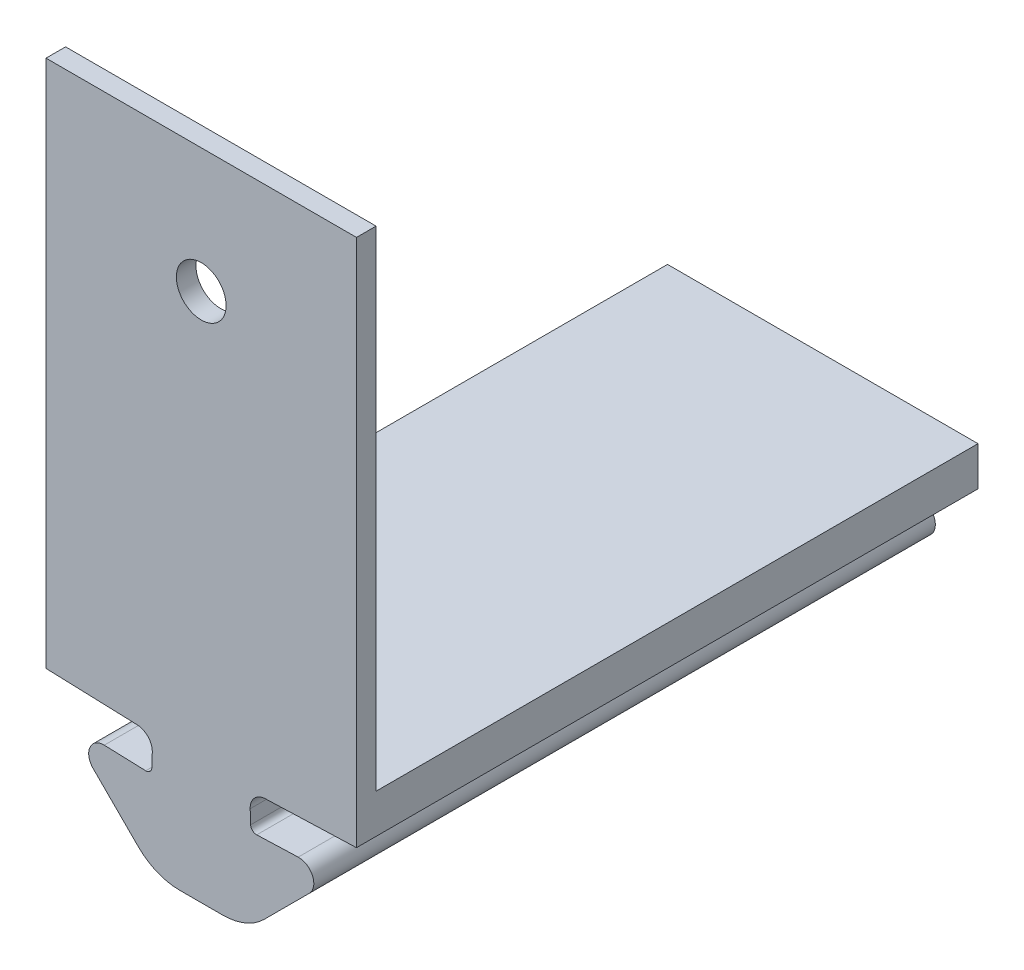
ISO-10303-21;
HEADER;
FILE_DESCRIPTION(('STEP AP214'),'2;1');
FILE_NAME('part.step','',(''),(''),'','','');
FILE_SCHEMA(('AUTOMOTIVE_DESIGN { 1 0 10303 214 1 1 1 1 }'));
ENDSEC;
DATA;
#1=APPLICATION_CONTEXT('core data for automotive mechanical design processes');
#2=APPLICATION_PROTOCOL_DEFINITION('international standard','automotive_design',2000,#1);
#3=PRODUCT_CONTEXT('',#1,'mechanical');
#4=PRODUCT('Part','Part','',(#3));
#5=PRODUCT_RELATED_PRODUCT_CATEGORY('part','',(#4));
#6=PRODUCT_DEFINITION_FORMATION('','',#4);
#7=PRODUCT_DEFINITION_CONTEXT('part definition',#1,'design');
#8=PRODUCT_DEFINITION('design','',#6,#7);
#9=PRODUCT_DEFINITION_SHAPE('','',#8);
#10=(LENGTH_UNIT() NAMED_UNIT(*) SI_UNIT(.MILLI.,.METRE.));
#11=(NAMED_UNIT(*) PLANE_ANGLE_UNIT() SI_UNIT($,.RADIAN.));
#12=(NAMED_UNIT(*) SI_UNIT($,.STERADIAN.) SOLID_ANGLE_UNIT());
#13=UNCERTAINTY_MEASURE_WITH_UNIT(LENGTH_MEASURE(1.E-05),#10,'distance_accuracy_value','');
#14=(GEOMETRIC_REPRESENTATION_CONTEXT(3) GLOBAL_UNCERTAINTY_ASSIGNED_CONTEXT((#13)) GLOBAL_UNIT_ASSIGNED_CONTEXT((#10,
#11,#12)) REPRESENTATION_CONTEXT('',''));
#15=CARTESIAN_POINT('',(0.,0.,0.));
#16=DIRECTION('',(0.,0.,1.));
#17=DIRECTION('',(1.,0.,0.));
#18=AXIS2_PLACEMENT_3D('',#15,#16,#17);
#19=CARTESIAN_POINT('',(-50.6754357820215,45.6203327442278,31.75));
#20=DIRECTION('',(0.,0.,-1.));
#21=DIRECTION('',(-1.,0.,0.));
#22=AXIS2_PLACEMENT_3D('',#19,#20,#21);
#23=CYLINDRICAL_SURFACE('',#22,0.300000000000002);
#24=CARTESIAN_POINT('',(-50.6754357820215,45.6203327442278,0.));
#25=DIRECTION('',(0.,0.,-1.));
#26=DIRECTION('',(1.,0.,0.));
#27=AXIS2_PLACEMENT_3D('',#24,#25,#26);
#28=CIRCLE('',#27,0.300000000000002);
#29=CARTESIAN_POINT('',(-50.3756185339158,45.609862895217,0.));
#30=VERTEX_POINT('',#29);
#31=CARTESIAN_POINT('',(-50.6859056310322,45.320515496122,0.));
#32=VERTEX_POINT('',#31);
#33=EDGE_CURVE('E167',#30,#32,#28,.T.);
#34=ORIENTED_EDGE('',*,*,#33,.T.);
#35=DIRECTION('',(0.,0.,-1.));
#36=VECTOR('',#35,1.);
#37=CARTESIAN_POINT('',(-50.6859056310322,45.320515496122,31.75));
#38=LINE('',#37,#36);
#39=CARTESIAN_POINT('',(-50.6859056310322,45.320515496122,31.75));
#40=VERTEX_POINT('',#39);
#41=EDGE_CURVE('E11',#40,#32,#38,.T.);
#42=ORIENTED_EDGE('',*,*,#41,.F.);
#43=CARTESIAN_POINT('',(-50.6754357820215,45.6203327442278,31.75));
#44=DIRECTION('',(0.,0.,-1.));
#45=DIRECTION('',(1.,0.,0.));
#46=AXIS2_PLACEMENT_3D('',#43,#44,#45);
#47=CIRCLE('',#46,0.300000000000002);
#48=CARTESIAN_POINT('',(-50.3756185339158,45.609862895217,31.75));
#49=VERTEX_POINT('',#48);
#50=EDGE_CURVE('E195',#49,#40,#47,.T.);
#51=ORIENTED_EDGE('',*,*,#50,.F.);
#52=DIRECTION('',(0.,0.,-1.));
#53=VECTOR('',#52,1.);
#54=CARTESIAN_POINT('',(-50.3756185339158,45.609862895217,31.75));
#55=LINE('',#54,#53);
#56=EDGE_CURVE('E163',#49,#30,#55,.T.);
#57=ORIENTED_EDGE('',*,*,#56,.T.);
#58=EDGE_LOOP('',(#34,#42,#51,#57));
#59=FACE_BOUND('',#58,.T.);
#60=ADVANCED_FACE('F47',(#59),#23,.F.);
#61=CARTESIAN_POINT('',(-50.6859056310322,45.320515496122,31.75));
#62=DIRECTION('',(-0.0348994967024436,-0.999390827019098,0.));
#63=DIRECTION('',(0.999390827019098,-0.0348994967024436,0.));
#64=AXIS2_PLACEMENT_3D('',#61,#62,#63);
#65=PLANE('',#64);
#66=DIRECTION('',(-0.999390827019098,0.0348994967024436,0.));
#67=VECTOR('',#66,1.);
#68=CARTESIAN_POINT('',(-50.6859056310322,45.320515496122,0.));
#69=LINE('',#68,#67);
#70=CARTESIAN_POINT('',(-52.803734095959,45.3944716957687,0.));
#71=VERTEX_POINT('',#70);
#72=EDGE_CURVE('E171',#32,#71,#69,.T.);
#73=ORIENTED_EDGE('',*,*,#72,.T.);
#74=DIRECTION('',(0.,0.,-1.));
#75=VECTOR('',#74,1.);
#76=CARTESIAN_POINT('',(-52.803734095959,45.3944716957687,31.75));
#77=LINE('',#76,#75);
#78=CARTESIAN_POINT('',(-52.803734095959,45.3944716957687,31.75));
#79=VERTEX_POINT('',#78);
#80=EDGE_CURVE('E55',#79,#71,#77,.T.);
#81=ORIENTED_EDGE('',*,*,#80,.F.);
#82=DIRECTION('',(-0.999390827019098,0.0348994967024436,0.));
#83=VECTOR('',#82,1.);
#84=CARTESIAN_POINT('',(-50.6859056310322,45.320515496122,31.75));
#85=LINE('',#84,#83);
#86=EDGE_CURVE('E115',#40,#79,#85,.T.);
#87=ORIENTED_EDGE('',*,*,#86,.F.);
#88=ORIENTED_EDGE('',*,*,#41,.T.);
#89=EDGE_LOOP('',(#73,#81,#87,#88));
#90=FACE_BOUND('',#89,.T.);
#91=ADVANCED_FACE('F506',(#90),#65,.F.);
#92=CARTESIAN_POINT('',(-52.8306099066512,44.6248491736012,31.75));
#93=DIRECTION('',(0.,0.,-1.));
#94=DIRECTION('',(-1.,0.,0.));
#95=AXIS2_PLACEMENT_3D('',#92,#93,#94);
#96=CYLINDRICAL_SURFACE('',#95,0.770091641188153);
#97=CARTESIAN_POINT('',(-52.8306099066512,44.6248491736012,0.));
#98=DIRECTION('',(0.,0.,1.));
#99=DIRECTION('',(1.,0.,0.));
#100=AXIS2_PLACEMENT_3D('',#97,#98,#99);
#101=CIRCLE('',#100,0.770091641188153);
#102=CARTESIAN_POINT('',(-53.3751469282704,44.0803121519819,0.));
#103=VERTEX_POINT('',#102);
#104=EDGE_CURVE('E175',#71,#103,#101,.T.);
#105=ORIENTED_EDGE('',*,*,#104,.T.);
#106=DIRECTION('',(0.,0.,-1.));
#107=VECTOR('',#106,1.);
#108=CARTESIAN_POINT('',(-53.3751469282704,44.0803121519819,31.75));
#109=LINE('',#108,#107);
#110=CARTESIAN_POINT('',(-53.3751469282704,44.0803121519819,31.75));
#111=VERTEX_POINT('',#110);
#112=EDGE_CURVE('E210',#111,#103,#109,.T.);
#113=ORIENTED_EDGE('',*,*,#112,.F.);
#114=CARTESIAN_POINT('',(-52.8306099066512,44.6248491736012,31.75));
#115=DIRECTION('',(0.,0.,1.));
#116=DIRECTION('',(1.,0.,0.));
#117=AXIS2_PLACEMENT_3D('',#114,#115,#116);
#118=CIRCLE('',#117,0.770091641188153);
#119=EDGE_CURVE('E220',#79,#111,#118,.T.);
#120=ORIENTED_EDGE('',*,*,#119,.F.);
#121=ORIENTED_EDGE('',*,*,#80,.T.);
#122=EDGE_LOOP('',(#105,#113,#120,#121));
#123=FACE_BOUND('',#122,.T.);
#124=ADVANCED_FACE('F218',(#123),#96,.T.);
#125=CARTESIAN_POINT('',(-51.0742666676735,41.7794318913851,31.75));
#126=DIRECTION('',(0.707106781186544,0.707106781186551,0.));
#127=DIRECTION('',(-0.707106781186551,0.707106781186544,0.));
#128=AXIS2_PLACEMENT_3D('',#125,#126,#127);
#129=PLANE('',#128);
#130=DIRECTION('',(0.707106781186551,-0.707106781186544,0.));
#131=VECTOR('',#130,1.);
#132=CARTESIAN_POINT('',(-51.0742666676735,41.7794318913851,0.));
#133=LINE('',#132,#131);
#134=CARTESIAN_POINT('',(-51.0742666676735,41.7794318913851,0.));
#135=VERTEX_POINT('',#134);
#136=EDGE_CURVE('E178',#103,#135,#133,.T.);
#137=ORIENTED_EDGE('',*,*,#136,.T.);
#138=DIRECTION('',(0.,0.,-1.));
#139=VECTOR('',#138,1.);
#140=CARTESIAN_POINT('',(-51.0742666676735,41.7794318913851,31.75));
#141=LINE('',#140,#139);
#142=CARTESIAN_POINT('',(-51.0742666676735,41.7794318913851,31.75));
#143=VERTEX_POINT('',#142);
#144=EDGE_CURVE('E206',#143,#135,#141,.T.);
#145=ORIENTED_EDGE('',*,*,#144,.F.);
#146=DIRECTION('',(0.707106781186551,-0.707106781186544,0.));
#147=VECTOR('',#146,1.);
#148=CARTESIAN_POINT('',(-51.0742666676735,41.7794318913851,31.75));
#149=LINE('',#148,#147);
#150=EDGE_CURVE('E239',#111,#143,#149,.T.);
#151=ORIENTED_EDGE('',*,*,#150,.F.);
#152=ORIENTED_EDGE('',*,*,#112,.T.);
#153=EDGE_LOOP('',(#137,#145,#151,#152));
#154=FACE_BOUND('',#153,.T.);
#155=ADVANCED_FACE('F229',(#154),#129,.F.);
#156=CARTESIAN_POINT('',(-48.9529463241139,43.9007522349447,31.75));
#157=DIRECTION('',(0.,0.,-1.));
#158=DIRECTION('',(-1.,0.,0.));
#159=AXIS2_PLACEMENT_3D('',#156,#157,#158);
#160=CYLINDRICAL_SURFACE('',#159,3.);
#161=CARTESIAN_POINT('',(-48.9529463241139,43.9007522349447,0.));
#162=DIRECTION('',(0.,0.,1.));
#163=DIRECTION('',(1.,0.,0.));
#164=AXIS2_PLACEMENT_3D('',#161,#162,#163);
#165=CIRCLE('',#164,3.);
#166=CARTESIAN_POINT('',(-48.9529463241139,40.9007522349447,0.));
#167=VERTEX_POINT('',#166);
#168=EDGE_CURVE('E181',#135,#167,#165,.T.);
#169=ORIENTED_EDGE('',*,*,#168,.T.);
#170=DIRECTION('',(0.,0.,-1.));
#171=VECTOR('',#170,1.);
#172=CARTESIAN_POINT('',(-48.9529463241139,40.9007522349447,31.75));
#173=LINE('',#172,#171);
#174=CARTESIAN_POINT('',(-48.9529463241139,40.9007522349447,31.75));
#175=VERTEX_POINT('',#174);
#176=EDGE_CURVE('E202',#175,#167,#173,.T.);
#177=ORIENTED_EDGE('',*,*,#176,.F.);
#178=CARTESIAN_POINT('',(-48.9529463241139,43.9007522349447,31.75));
#179=DIRECTION('',(0.,0.,1.));
#180=DIRECTION('',(1.,0.,0.));
#181=AXIS2_PLACEMENT_3D('',#178,#179,#180);
#182=CIRCLE('',#181,3.);
#183=EDGE_CURVE('E235',#143,#175,#182,.T.);
#184=ORIENTED_EDGE('',*,*,#183,.F.);
#185=ORIENTED_EDGE('',*,*,#144,.T.);
#186=EDGE_LOOP('',(#169,#177,#184,#185));
#187=FACE_BOUND('',#186,.T.);
#188=ADVANCED_FACE('F233',(#187),#160,.T.);
#189=CARTESIAN_POINT('',(-47.8507015478393,40.9007522349447,31.75));
#190=DIRECTION('',(0.,1.,0.));
#191=DIRECTION('',(0.,0.,1.));
#192=AXIS2_PLACEMENT_3D('',#189,#190,#191);
#193=PLANE('',#192);
#194=DIRECTION('',(1.,0.,0.));
#195=VECTOR('',#194,1.);
#196=CARTESIAN_POINT('',(-47.8507015478393,40.9007522349447,0.));
#197=LINE('',#196,#195);
#198=CARTESIAN_POINT('',(-46.7484567715648,40.9007522349447,0.));
#199=VERTEX_POINT('',#198);
#200=EDGE_CURVE('E184',#167,#199,#197,.T.);
#201=ORIENTED_EDGE('',*,*,#200,.T.);
#202=DIRECTION('',(0.,0.,-1.));
#203=VECTOR('',#202,1.);
#204=CARTESIAN_POINT('',(-46.7484567715648,40.9007522349447,31.75));
#205=LINE('',#204,#203);
#206=CARTESIAN_POINT('',(-46.7484567715648,40.9007522349447,31.75));
#207=VERTEX_POINT('',#206);
#208=EDGE_CURVE('E266',#207,#199,#205,.T.);
#209=ORIENTED_EDGE('',*,*,#208,.F.);
#210=DIRECTION('',(1.,0.,0.));
#211=VECTOR('',#210,1.);
#212=CARTESIAN_POINT('',(-47.8507015478393,40.9007522349447,31.75));
#213=LINE('',#212,#211);
#214=EDGE_CURVE('E146',#175,#207,#213,.T.);
#215=ORIENTED_EDGE('',*,*,#214,.F.);
#216=ORIENTED_EDGE('',*,*,#176,.T.);
#217=EDGE_LOOP('',(#201,#209,#215,#216));
#218=FACE_BOUND('',#217,.T.);
#219=ADVANCED_FACE('F528',(#218),#193,.F.);
#220=CARTESIAN_POINT('',(-55.7809025544344,47.2995338889829,31.75));
#221=DIRECTION('',(0.0348994967024436,0.999390827019098,0.));
#222=DIRECTION('',(-0.999390827019098,0.0348994967024436,0.));
#223=AXIS2_PLACEMENT_3D('',#220,#221,#222);
#224=PLANE('',#223);
#225=DIRECTION('',(0.999390827019098,-0.0348994967024436,0.));
#226=VECTOR('',#225,1.);
#227=CARTESIAN_POINT('',(-55.7809025544344,47.2995338889829,0.));
#228=LINE('',#227,#226);
#229=CARTESIAN_POINT('',(-55.7809025544344,47.2995338889829,0.));
#230=VERTEX_POINT('',#229);
#231=CARTESIAN_POINT('',(-51.1227819504774,47.1368687331076,0.));
#232=VERTEX_POINT('',#231);
#233=EDGE_CURVE('E152',#230,#232,#228,.T.);
#234=ORIENTED_EDGE('',*,*,#233,.T.);
#235=DIRECTION('',(0.,0.,-1.));
#236=VECTOR('',#235,1.);
#237=CARTESIAN_POINT('',(-51.1227819504774,47.1368687331076,31.75));
#238=LINE('',#237,#236);
#239=CARTESIAN_POINT('',(-51.1227819504774,47.1368687331076,31.75));
#240=VERTEX_POINT('',#239);
#241=EDGE_CURVE('E149',#240,#232,#238,.T.);
#242=ORIENTED_EDGE('',*,*,#241,.F.);
#243=DIRECTION('',(0.999390827019098,-0.0348994967024436,0.));
#244=VECTOR('',#243,1.);
#245=CARTESIAN_POINT('',(-55.7809025544344,47.2995338889829,31.75));
#246=LINE('',#245,#244);
#247=CARTESIAN_POINT('',(-55.7809025544344,47.2995338889829,31.75));
#248=VERTEX_POINT('',#247);
#249=EDGE_CURVE('E134',#248,#240,#246,.T.);
#250=ORIENTED_EDGE('',*,*,#249,.F.);
#251=DIRECTION('',(0.,0.,-1.));
#252=VECTOR('',#251,1.);
#253=CARTESIAN_POINT('',(-55.7809025544344,47.2995338889829,31.75));
#254=LINE('',#253,#252);
#255=EDGE_CURVE('E156',#248,#230,#254,.T.);
#256=ORIENTED_EDGE('',*,*,#255,.T.);
#257=EDGE_LOOP('',(#234,#242,#250,#256));
#258=FACE_BOUND('',#257,.T.);
#259=ADVANCED_FACE('F150',(#258),#224,.F.);
#260=CARTESIAN_POINT('',(-51.1507015478393,46.3373560714924,31.75));
#261=DIRECTION('',(0.,0.,-1.));
#262=DIRECTION('',(-1.,0.,0.));
#263=AXIS2_PLACEMENT_3D('',#260,#261,#262);
#264=CYLINDRICAL_SURFACE('',#263,0.799999999999997);
#265=CARTESIAN_POINT('',(-51.1507015478393,46.3373560714924,0.));
#266=DIRECTION('',(0.,0.,-1.));
#267=DIRECTION('',(1.,0.,0.));
#268=AXIS2_PLACEMENT_3D('',#265,#266,#267);
#269=CIRCLE('',#268,0.799999999999997);
#270=CARTESIAN_POINT('',(-50.3511888862241,46.3094364741304,0.));
#271=VERTEX_POINT('',#270);
#272=EDGE_CURVE('E190',#232,#271,#269,.T.);
#273=ORIENTED_EDGE('',*,*,#272,.T.);
#274=DIRECTION('',(0.,0.,-1.));
#275=VECTOR('',#274,1.);
#276=CARTESIAN_POINT('',(-50.3511888862241,46.3094364741304,31.75));
#277=LINE('',#276,#275);
#278=CARTESIAN_POINT('',(-50.3511888862241,46.3094364741304,31.75));
#279=VERTEX_POINT('',#278);
#280=EDGE_CURVE('E157',#279,#271,#277,.T.);
#281=ORIENTED_EDGE('',*,*,#280,.F.);
#282=CARTESIAN_POINT('',(-51.1507015478393,46.3373560714924,31.75));
#283=DIRECTION('',(0.,0.,-1.));
#284=DIRECTION('',(1.,0.,0.));
#285=AXIS2_PLACEMENT_3D('',#282,#283,#284);
#286=CIRCLE('',#285,0.799999999999997);
#287=EDGE_CURVE('E138',#240,#279,#286,.T.);
#288=ORIENTED_EDGE('',*,*,#287,.F.);
#289=ORIENTED_EDGE('',*,*,#241,.T.);
#290=EDGE_LOOP('',(#273,#281,#288,#289));
#291=FACE_BOUND('',#290,.T.);
#292=ADVANCED_FACE('F159',(#291),#264,.F.);
#293=CARTESIAN_POINT('',(-50.3756185339158,45.609862895217,31.75));
#294=DIRECTION('',(0.999390827019098,-0.034899496702436,0.));
#295=DIRECTION('',(0.034899496702436,0.999390827019098,0.));
#296=AXIS2_PLACEMENT_3D('',#293,#294,#295);
#297=PLANE('',#296);
#298=DIRECTION('',(-0.034899496702436,-0.999390827019098,0.));
#299=VECTOR('',#298,1.);
#300=CARTESIAN_POINT('',(-50.3756185339158,45.609862895217,0.));
#301=LINE('',#300,#299);
#302=EDGE_CURVE('E107',#271,#30,#301,.T.);
#303=ORIENTED_EDGE('',*,*,#302,.T.);
#304=ORIENTED_EDGE('',*,*,#56,.F.);
#305=DIRECTION('',(-0.034899496702436,-0.999390827019098,0.));
#306=VECTOR('',#305,1.);
#307=CARTESIAN_POINT('',(-50.3756185339158,45.609862895217,31.75));
#308=LINE('',#307,#306);
#309=EDGE_CURVE('E71',#279,#49,#308,.T.);
#310=ORIENTED_EDGE('',*,*,#309,.F.);
#311=ORIENTED_EDGE('',*,*,#280,.T.);
#312=EDGE_LOOP('',(#303,#304,#310,#311));
#313=FACE_BOUND('',#312,.T.);
#314=ADVANCED_FACE('F514',(#313),#297,.F.);
#315=CARTESIAN_POINT('',(-50.6754357820215,45.6203327442278,31.75));
#316=DIRECTION('',(0.,0.,1.));
#317=DIRECTION('',(1.,0.,0.));
#318=AXIS2_PLACEMENT_3D('',#315,#316,#317);
#319=PLANE('',#318);
#320=CARTESIAN_POINT('',(-47.8507015478393,67.9495338889829,31.75));
#321=DIRECTION('',(0.,0.,1.));
#322=DIRECTION('',(1.,0.,0.));
#323=AXIS2_PLACEMENT_3D('',#320,#321,#322);
#324=CIRCLE('',#323,1.27);
#325=CARTESIAN_POINT('',(-46.5807015478393,67.9495338889829,31.75));
#326=VERTEX_POINT('',#325);
#327=EDGE_CURVE('E386',#326,#326,#324,.T.);
#328=ORIENTED_EDGE('',*,*,#327,.F.);
#329=EDGE_LOOP('',(#328));
#330=FACE_BOUND('',#329,.T.);
#331=ORIENTED_EDGE('',*,*,#50,.T.);
#332=ORIENTED_EDGE('',*,*,#86,.T.);
#333=ORIENTED_EDGE('',*,*,#119,.T.);
#334=ORIENTED_EDGE('',*,*,#150,.T.);
#335=ORIENTED_EDGE('',*,*,#183,.T.);
#336=ORIENTED_EDGE('',*,*,#214,.T.);
#337=CARTESIAN_POINT('',(-46.7484567715648,43.9007522349447,31.75));
#338=DIRECTION('',(0.,0.,-1.));
#339=DIRECTION('',(-1.,0.,0.));
#340=AXIS2_PLACEMENT_3D('',#337,#338,#339);
#341=CIRCLE('',#340,3.);
#342=CARTESIAN_POINT('',(-44.6271364280052,41.7794318913851,31.75));
#343=VERTEX_POINT('',#342);
#344=EDGE_CURVE('E331',#343,#207,#341,.T.);
#345=ORIENTED_EDGE('',*,*,#344,.F.);
#346=DIRECTION('',(-0.707106781186551,-0.707106781186544,0.));
#347=VECTOR('',#346,1.);
#348=CARTESIAN_POINT('',(-44.6271364280052,41.7794318913851,31.75));
#349=LINE('',#348,#347);
#350=CARTESIAN_POINT('',(-42.3262561674083,44.0803121519819,31.75));
#351=VERTEX_POINT('',#350);
#352=EDGE_CURVE('E327',#351,#343,#349,.T.);
#353=ORIENTED_EDGE('',*,*,#352,.F.);
#354=CARTESIAN_POINT('',(-42.8707931890275,44.6248491736012,31.75));
#355=DIRECTION('',(0.,0.,-1.));
#356=DIRECTION('',(-1.,0.,0.));
#357=AXIS2_PLACEMENT_3D('',#354,#355,#356);
#358=CIRCLE('',#357,0.770091641188153);
#359=CARTESIAN_POINT('',(-42.8976689997197,45.3944716957687,31.75));
#360=VERTEX_POINT('',#359);
#361=EDGE_CURVE('E323',#360,#351,#358,.T.);
#362=ORIENTED_EDGE('',*,*,#361,.F.);
#363=DIRECTION('',(0.999390827019098,0.0348994967024436,0.));
#364=VECTOR('',#363,1.);
#365=CARTESIAN_POINT('',(-45.0154974646464,45.320515496122,31.75));
#366=LINE('',#365,#364);
#367=CARTESIAN_POINT('',(-45.0154974646464,45.320515496122,31.75));
#368=VERTEX_POINT('',#367);
#369=EDGE_CURVE('E286',#368,#360,#366,.T.);
#370=ORIENTED_EDGE('',*,*,#369,.F.);
#371=CARTESIAN_POINT('',(-45.0259673136572,45.6203327442278,31.75));
#372=DIRECTION('',(0.,0.,1.));
#373=DIRECTION('',(-1.,0.,0.));
#374=AXIS2_PLACEMENT_3D('',#371,#372,#373);
#375=CIRCLE('',#374,0.300000000000002);
#376=CARTESIAN_POINT('',(-45.3257845617629,45.609862895217,31.75));
#377=VERTEX_POINT('',#376);
#378=EDGE_CURVE('E291',#377,#368,#375,.T.);
#379=ORIENTED_EDGE('',*,*,#378,.F.);
#380=DIRECTION('',(0.034899496702436,-0.999390827019098,0.));
#381=VECTOR('',#380,1.);
#382=CARTESIAN_POINT('',(-45.3257845617629,45.609862895217,31.75));
#383=LINE('',#382,#381);
#384=CARTESIAN_POINT('',(-45.3502142094546,46.3094364741304,31.75));
#385=VERTEX_POINT('',#384);
#386=EDGE_CURVE('E343',#385,#377,#383,.T.);
#387=ORIENTED_EDGE('',*,*,#386,.F.);
#388=CARTESIAN_POINT('',(-44.5507015478393,46.3373560714924,31.75));
#389=DIRECTION('',(0.,0.,1.));
#390=DIRECTION('',(-1.,0.,0.));
#391=AXIS2_PLACEMENT_3D('',#388,#389,#390);
#392=CIRCLE('',#391,0.799999999999997);
#393=CARTESIAN_POINT('',(-44.5786211452013,47.1368687331076,31.75));
#394=VERTEX_POINT('',#393);
#395=EDGE_CURVE('E339',#394,#385,#392,.T.);
#396=ORIENTED_EDGE('',*,*,#395,.F.);
#397=DIRECTION('',(-0.999390827019098,-0.0348994967024436,0.));
#398=VECTOR('',#397,1.);
#399=CARTESIAN_POINT('',(-39.9205005412442,47.2995338889829,31.75));
#400=LINE('',#399,#398);
#401=CARTESIAN_POINT('',(-39.9205005412442,47.2995338889829,31.75));
#402=VERTEX_POINT('',#401);
#403=EDGE_CURVE('E335',#402,#394,#400,.T.);
#404=ORIENTED_EDGE('',*,*,#403,.F.);
#405=DIRECTION('',(0.,-1.,0.));
#406=VECTOR('',#405,1.);
#407=CARTESIAN_POINT('',(-39.9205005412442,49.2995338889829,31.75));
#408=LINE('',#407,#406);
#409=CARTESIAN_POINT('',(-39.9205005412442,74.2995338889829,31.75));
#410=VERTEX_POINT('',#409);
#411=EDGE_CURVE('E352',#410,#402,#408,.T.);
#412=ORIENTED_EDGE('',*,*,#411,.F.);
#413=DIRECTION('',(1.,0.,0.));
#414=VECTOR('',#413,1.);
#415=CARTESIAN_POINT('',(-55.7809025544344,74.2995338889829,31.75));
#416=LINE('',#415,#414);
#417=CARTESIAN_POINT('',(-55.7809025544344,74.2995338889829,31.75));
#418=VERTEX_POINT('',#417);
#419=EDGE_CURVE('E394',#418,#410,#416,.T.);
#420=ORIENTED_EDGE('',*,*,#419,.F.);
#421=DIRECTION('',(0.,-1.,0.));
#422=VECTOR('',#421,1.);
#423=CARTESIAN_POINT('',(-55.7809025544344,49.2995338889829,31.75));
#424=LINE('',#423,#422);
#425=EDGE_CURVE('E142',#418,#248,#424,.T.);
#426=ORIENTED_EDGE('',*,*,#425,.T.);
#427=ORIENTED_EDGE('',*,*,#249,.T.);
#428=ORIENTED_EDGE('',*,*,#287,.T.);
#429=ORIENTED_EDGE('',*,*,#309,.T.);
#430=EDGE_LOOP('',(#331,#332,#333,#334,#335,#336,#345,#353,#362,#370,#379,#387,#396,#404,#412,
#420,#426,#427,#428,#429));
#431=FACE_BOUND('',#430,.T.);
#432=ADVANCED_FACE('F136',(#330,#431),#319,.T.);
#433=CARTESIAN_POINT('',(-50.6754357820215,45.6203327442278,0.));
#434=DIRECTION('',(0.,0.,1.));
#435=DIRECTION('',(1.,0.,0.));
#436=AXIS2_PLACEMENT_3D('',#433,#434,#435);
#437=PLANE('',#436);
#438=ORIENTED_EDGE('',*,*,#33,.F.);
#439=ORIENTED_EDGE('',*,*,#302,.F.);
#440=ORIENTED_EDGE('',*,*,#272,.F.);
#441=ORIENTED_EDGE('',*,*,#233,.F.);
#442=DIRECTION('',(0.,-1.,0.));
#443=VECTOR('',#442,1.);
#444=CARTESIAN_POINT('',(-55.7809025544344,49.2995338889829,0.));
#445=LINE('',#444,#443);
#446=CARTESIAN_POINT('',(-55.7809025544344,49.2995338889829,0.));
#447=VERTEX_POINT('',#446);
#448=EDGE_CURVE('E360',#447,#230,#445,.T.);
#449=ORIENTED_EDGE('',*,*,#448,.F.);
#450=DIRECTION('',(-1.,0.,0.));
#451=VECTOR('',#450,1.);
#452=CARTESIAN_POINT('',(-55.7809025544344,49.2995338889829,0.));
#453=LINE('',#452,#451);
#454=CARTESIAN_POINT('',(-39.9205005412442,49.2995338889829,0.));
#455=VERTEX_POINT('',#454);
#456=EDGE_CURVE('E364',#455,#447,#453,.T.);
#457=ORIENTED_EDGE('',*,*,#456,.F.);
#458=DIRECTION('',(0.,-1.,0.));
#459=VECTOR('',#458,1.);
#460=CARTESIAN_POINT('',(-39.9205005412442,49.2995338889829,0.));
#461=LINE('',#460,#459);
#462=CARTESIAN_POINT('',(-39.9205005412442,47.2995338889829,0.));
#463=VERTEX_POINT('',#462);
#464=EDGE_CURVE('E356',#455,#463,#461,.T.);
#465=ORIENTED_EDGE('',*,*,#464,.T.);
#466=DIRECTION('',(-0.999390827019098,-0.0348994967024436,0.));
#467=VECTOR('',#466,1.);
#468=CARTESIAN_POINT('',(-39.9205005412442,47.2995338889829,0.));
#469=LINE('',#468,#467);
#470=CARTESIAN_POINT('',(-44.5786211452013,47.1368687331076,0.));
#471=VERTEX_POINT('',#470);
#472=EDGE_CURVE('E304',#463,#471,#469,.T.);
#473=ORIENTED_EDGE('',*,*,#472,.T.);
#474=CARTESIAN_POINT('',(-44.5507015478393,46.3373560714924,0.));
#475=DIRECTION('',(0.,0.,1.));
#476=DIRECTION('',(-1.,0.,0.));
#477=AXIS2_PLACEMENT_3D('',#474,#475,#476);
#478=CIRCLE('',#477,0.799999999999997);
#479=CARTESIAN_POINT('',(-45.3502142094546,46.3094364741304,0.));
#480=VERTEX_POINT('',#479);
#481=EDGE_CURVE('E308',#471,#480,#478,.T.);
#482=ORIENTED_EDGE('',*,*,#481,.T.);
#483=DIRECTION('',(0.034899496702436,-0.999390827019098,0.));
#484=VECTOR('',#483,1.);
#485=CARTESIAN_POINT('',(-45.3257845617629,45.609862895217,0.));
#486=LINE('',#485,#484);
#487=CARTESIAN_POINT('',(-45.3257845617629,45.609862895217,0.));
#488=VERTEX_POINT('',#487);
#489=EDGE_CURVE('E312',#480,#488,#486,.T.);
#490=ORIENTED_EDGE('',*,*,#489,.T.);
#491=CARTESIAN_POINT('',(-45.0259673136572,45.6203327442278,0.));
#492=DIRECTION('',(0.,0.,1.));
#493=DIRECTION('',(-1.,0.,0.));
#494=AXIS2_PLACEMENT_3D('',#491,#492,#493);
#495=CIRCLE('',#494,0.300000000000002);
#496=CARTESIAN_POINT('',(-45.0154974646464,45.320515496122,0.));
#497=VERTEX_POINT('',#496);
#498=EDGE_CURVE('E316',#488,#497,#495,.T.);
#499=ORIENTED_EDGE('',*,*,#498,.T.);
#500=DIRECTION('',(0.999390827019098,0.0348994967024436,0.));
#501=VECTOR('',#500,1.);
#502=CARTESIAN_POINT('',(-45.0154974646464,45.320515496122,0.));
#503=LINE('',#502,#501);
#504=CARTESIAN_POINT('',(-42.8976689997197,45.3944716957687,0.));
#505=VERTEX_POINT('',#504);
#506=EDGE_CURVE('E287',#497,#505,#503,.T.);
#507=ORIENTED_EDGE('',*,*,#506,.T.);
#508=CARTESIAN_POINT('',(-42.8707931890275,44.6248491736012,0.));
#509=DIRECTION('',(0.,0.,-1.));
#510=DIRECTION('',(-1.,0.,0.));
#511=AXIS2_PLACEMENT_3D('',#508,#509,#510);
#512=CIRCLE('',#511,0.770091641188153);
#513=CARTESIAN_POINT('',(-42.3262561674083,44.0803121519819,0.));
#514=VERTEX_POINT('',#513);
#515=EDGE_CURVE('E292',#505,#514,#512,.T.);
#516=ORIENTED_EDGE('',*,*,#515,.T.);
#517=DIRECTION('',(-0.707106781186551,-0.707106781186544,0.));
#518=VECTOR('',#517,1.);
#519=CARTESIAN_POINT('',(-44.6271364280052,41.7794318913851,0.));
#520=LINE('',#519,#518);
#521=CARTESIAN_POINT('',(-44.6271364280052,41.7794318913851,0.));
#522=VERTEX_POINT('',#521);
#523=EDGE_CURVE('E296',#514,#522,#520,.T.);
#524=ORIENTED_EDGE('',*,*,#523,.T.);
#525=CARTESIAN_POINT('',(-46.7484567715648,43.9007522349447,0.));
#526=DIRECTION('',(0.,0.,-1.));
#527=DIRECTION('',(-1.,0.,0.));
#528=AXIS2_PLACEMENT_3D('',#525,#526,#527);
#529=CIRCLE('',#528,3.);
#530=EDGE_CURVE('E300',#522,#199,#529,.T.);
#531=ORIENTED_EDGE('',*,*,#530,.T.);
#532=ORIENTED_EDGE('',*,*,#200,.F.);
#533=ORIENTED_EDGE('',*,*,#168,.F.);
#534=ORIENTED_EDGE('',*,*,#136,.F.);
#535=ORIENTED_EDGE('',*,*,#104,.F.);
#536=ORIENTED_EDGE('',*,*,#72,.F.);
#537=EDGE_LOOP('',(#438,#439,#440,#441,#449,#457,#465,#473,#482,#490,#499,#507,#516,#524,#531,
#532,#533,#534,#535,#536));
#538=FACE_BOUND('',#537,.T.);
#539=ADVANCED_FACE('F224',(#538),#437,.F.);
#540=CARTESIAN_POINT('',(-45.0259673136572,45.6203327442278,31.75));
#541=DIRECTION('',(0.,0.,-1.));
#542=DIRECTION('',(-1.,0.,0.));
#543=AXIS2_PLACEMENT_3D('',#540,#541,#542);
#544=CYLINDRICAL_SURFACE('',#543,0.300000000000002);
#545=ORIENTED_EDGE('',*,*,#498,.F.);
#546=DIRECTION('',(0.,0.,-1.));
#547=VECTOR('',#546,1.);
#548=CARTESIAN_POINT('',(-45.3257845617629,45.609862895217,31.75));
#549=LINE('',#548,#547);
#550=EDGE_CURVE('E172',#377,#488,#549,.T.);
#551=ORIENTED_EDGE('',*,*,#550,.F.);
#552=ORIENTED_EDGE('',*,*,#378,.T.);
#553=DIRECTION('',(0.,0.,-1.));
#554=VECTOR('',#553,1.);
#555=CARTESIAN_POINT('',(-45.0154974646464,45.320515496122,31.75));
#556=LINE('',#555,#554);
#557=EDGE_CURVE('E282',#368,#497,#556,.T.);
#558=ORIENTED_EDGE('',*,*,#557,.T.);
#559=EDGE_LOOP('',(#545,#551,#552,#558));
#560=FACE_BOUND('',#559,.T.);
#561=ADVANCED_FACE('F487',(#560),#544,.F.);
#562=CARTESIAN_POINT('',(-45.3257845617629,45.609862895217,31.75));
#563=DIRECTION('',(0.999390827019098,0.034899496702436,0.));
#564=DIRECTION('',(-0.034899496702436,0.999390827019098,0.));
#565=AXIS2_PLACEMENT_3D('',#562,#563,#564);
#566=PLANE('',#565);
#567=ORIENTED_EDGE('',*,*,#489,.F.);
#568=DIRECTION('',(0.,0.,-1.));
#569=VECTOR('',#568,1.);
#570=CARTESIAN_POINT('',(-45.3502142094546,46.3094364741304,31.75));
#571=LINE('',#570,#569);
#572=EDGE_CURVE('E254',#385,#480,#571,.T.);
#573=ORIENTED_EDGE('',*,*,#572,.F.);
#574=ORIENTED_EDGE('',*,*,#386,.T.);
#575=ORIENTED_EDGE('',*,*,#550,.T.);
#576=EDGE_LOOP('',(#567,#573,#574,#575));
#577=FACE_BOUND('',#576,.T.);
#578=ADVANCED_FACE('F599',(#577),#566,.T.);
#579=CARTESIAN_POINT('',(-44.5507015478393,46.3373560714924,31.75));
#580=DIRECTION('',(0.,0.,-1.));
#581=DIRECTION('',(-1.,0.,0.));
#582=AXIS2_PLACEMENT_3D('',#579,#580,#581);
#583=CYLINDRICAL_SURFACE('',#582,0.799999999999997);
#584=ORIENTED_EDGE('',*,*,#481,.F.);
#585=DIRECTION('',(0.,0.,-1.));
#586=VECTOR('',#585,1.);
#587=CARTESIAN_POINT('',(-44.5786211452013,47.1368687331076,31.75));
#588=LINE('',#587,#586);
#589=EDGE_CURVE('E258',#394,#471,#588,.T.);
#590=ORIENTED_EDGE('',*,*,#589,.F.);
#591=ORIENTED_EDGE('',*,*,#395,.T.);
#592=ORIENTED_EDGE('',*,*,#572,.T.);
#593=EDGE_LOOP('',(#584,#590,#591,#592));
#594=FACE_BOUND('',#593,.T.);
#595=ADVANCED_FACE('F606',(#594),#583,.F.);
#596=CARTESIAN_POINT('',(-39.9205005412442,47.2995338889829,31.75));
#597=DIRECTION('',(0.0348994967024436,-0.999390827019098,0.));
#598=DIRECTION('',(0.999390827019098,0.0348994967024436,0.));
#599=AXIS2_PLACEMENT_3D('',#596,#597,#598);
#600=PLANE('',#599);
#601=ORIENTED_EDGE('',*,*,#472,.F.);
#602=DIRECTION('',(0.,0.,-1.));
#603=VECTOR('',#602,1.);
#604=CARTESIAN_POINT('',(-39.9205005412442,47.2995338889829,31.75));
#605=LINE('',#604,#603);
#606=EDGE_CURVE('E262',#402,#463,#605,.T.);
#607=ORIENTED_EDGE('',*,*,#606,.F.);
#608=ORIENTED_EDGE('',*,*,#403,.T.);
#609=ORIENTED_EDGE('',*,*,#589,.T.);
#610=EDGE_LOOP('',(#601,#607,#608,#609));
#611=FACE_BOUND('',#610,.T.);
#612=ADVANCED_FACE('F615',(#611),#600,.T.);
#613=CARTESIAN_POINT('',(-46.7484567715648,43.9007522349447,31.75));
#614=DIRECTION('',(0.,0.,-1.));
#615=DIRECTION('',(-1.,0.,0.));
#616=AXIS2_PLACEMENT_3D('',#613,#614,#615);
#617=CYLINDRICAL_SURFACE('',#616,3.);
#618=ORIENTED_EDGE('',*,*,#530,.F.);
#619=DIRECTION('',(0.,0.,-1.));
#620=VECTOR('',#619,1.);
#621=CARTESIAN_POINT('',(-44.6271364280052,41.7794318913851,31.75));
#622=LINE('',#621,#620);
#623=EDGE_CURVE('E270',#343,#522,#622,.T.);
#624=ORIENTED_EDGE('',*,*,#623,.F.);
#625=ORIENTED_EDGE('',*,*,#344,.T.);
#626=ORIENTED_EDGE('',*,*,#208,.T.);
#627=EDGE_LOOP('',(#618,#624,#625,#626));
#628=FACE_BOUND('',#627,.T.);
#629=ADVANCED_FACE('F622',(#628),#617,.T.);
#630=CARTESIAN_POINT('',(-44.6271364280052,41.7794318913851,31.75));
#631=DIRECTION('',(0.707106781186544,-0.707106781186551,0.));
#632=DIRECTION('',(0.707106781186551,0.707106781186544,0.));
#633=AXIS2_PLACEMENT_3D('',#630,#631,#632);
#634=PLANE('',#633);
#635=ORIENTED_EDGE('',*,*,#523,.F.);
#636=DIRECTION('',(0.,0.,-1.));
#637=VECTOR('',#636,1.);
#638=CARTESIAN_POINT('',(-42.3262561674083,44.0803121519819,31.75));
#639=LINE('',#638,#637);
#640=EDGE_CURVE('E274',#351,#514,#639,.T.);
#641=ORIENTED_EDGE('',*,*,#640,.F.);
#642=ORIENTED_EDGE('',*,*,#352,.T.);
#643=ORIENTED_EDGE('',*,*,#623,.T.);
#644=EDGE_LOOP('',(#635,#641,#642,#643));
#645=FACE_BOUND('',#644,.T.);
#646=ADVANCED_FACE('F502',(#645),#634,.T.);
#647=CARTESIAN_POINT('',(-42.8707931890275,44.6248491736012,31.75));
#648=DIRECTION('',(0.,0.,-1.));
#649=DIRECTION('',(-1.,0.,0.));
#650=AXIS2_PLACEMENT_3D('',#647,#648,#649);
#651=CYLINDRICAL_SURFACE('',#650,0.770091641188153);
#652=ORIENTED_EDGE('',*,*,#515,.F.);
#653=DIRECTION('',(0.,0.,-1.));
#654=VECTOR('',#653,1.);
#655=CARTESIAN_POINT('',(-42.8976689997197,45.3944716957687,31.75));
#656=LINE('',#655,#654);
#657=EDGE_CURVE('E278',#360,#505,#656,.T.);
#658=ORIENTED_EDGE('',*,*,#657,.F.);
#659=ORIENTED_EDGE('',*,*,#361,.T.);
#660=ORIENTED_EDGE('',*,*,#640,.T.);
#661=EDGE_LOOP('',(#652,#658,#659,#660));
#662=FACE_BOUND('',#661,.T.);
#663=ADVANCED_FACE('F493',(#662),#651,.T.);
#664=CARTESIAN_POINT('',(-45.0154974646464,45.320515496122,31.75));
#665=DIRECTION('',(-0.0348994967024436,0.999390827019098,0.));
#666=DIRECTION('',(-0.999390827019098,-0.0348994967024436,0.));
#667=AXIS2_PLACEMENT_3D('',#664,#665,#666);
#668=PLANE('',#667);
#669=ORIENTED_EDGE('',*,*,#506,.F.);
#670=ORIENTED_EDGE('',*,*,#557,.F.);
#671=ORIENTED_EDGE('',*,*,#369,.T.);
#672=ORIENTED_EDGE('',*,*,#657,.T.);
#673=EDGE_LOOP('',(#669,#670,#671,#672));
#674=FACE_BOUND('',#673,.T.);
#675=ADVANCED_FACE('F491',(#674),#668,.T.);
#676=CARTESIAN_POINT('',(-55.7809025544344,49.2995338889829,0.));
#677=DIRECTION('',(1.,0.,0.));
#678=DIRECTION('',(0.,0.,-1.));
#679=AXIS2_PLACEMENT_3D('',#676,#677,#678);
#680=PLANE('',#679);
#681=ORIENTED_EDGE('',*,*,#255,.F.);
#682=ORIENTED_EDGE('',*,*,#425,.F.);
#683=DIRECTION('',(0.,0.,1.));
#684=VECTOR('',#683,1.);
#685=CARTESIAN_POINT('',(-55.7809025544344,74.2995338889829,30.75));
#686=LINE('',#685,#684);
#687=CARTESIAN_POINT('',(-55.7809025544344,74.2995338889829,30.75));
#688=VERTEX_POINT('',#687);
#689=EDGE_CURVE('E385',#688,#418,#686,.T.);
#690=ORIENTED_EDGE('',*,*,#689,.F.);
#691=DIRECTION('',(0.,-1.,0.));
#692=VECTOR('',#691,1.);
#693=CARTESIAN_POINT('',(-55.7809025544344,74.2995338889829,30.75));
#694=LINE('',#693,#692);
#695=CARTESIAN_POINT('',(-55.7809025544344,49.2995338889829,30.75));
#696=VERTEX_POINT('',#695);
#697=EDGE_CURVE('E378',#688,#696,#694,.T.);
#698=ORIENTED_EDGE('',*,*,#697,.T.);
#699=DIRECTION('',(0.,0.,1.));
#700=VECTOR('',#699,1.);
#701=CARTESIAN_POINT('',(-55.7809025544344,49.2995338889829,0.));
#702=LINE('',#701,#700);
#703=EDGE_CURVE('E371',#447,#696,#702,.T.);
#704=ORIENTED_EDGE('',*,*,#703,.F.);
#705=ORIENTED_EDGE('',*,*,#448,.T.);
#706=EDGE_LOOP('',(#681,#682,#690,#698,#704,#705));
#707=FACE_BOUND('',#706,.T.);
#708=ADVANCED_FACE('F427',(#707),#680,.F.);
#709=CARTESIAN_POINT('',(-39.9205005412442,49.2995338889829,0.));
#710=DIRECTION('',(-1.,0.,0.));
#711=DIRECTION('',(0.,0.,1.));
#712=AXIS2_PLACEMENT_3D('',#709,#710,#711);
#713=PLANE('',#712);
#714=ORIENTED_EDGE('',*,*,#606,.T.);
#715=ORIENTED_EDGE('',*,*,#464,.F.);
#716=DIRECTION('',(0.,0.,-1.));
#717=VECTOR('',#716,1.);
#718=CARTESIAN_POINT('',(-39.9205005412442,49.2995338889829,0.));
#719=LINE('',#718,#717);
#720=CARTESIAN_POINT('',(-39.9205005412442,49.2995338889829,30.75));
#721=VERTEX_POINT('',#720);
#722=EDGE_CURVE('E368',#721,#455,#719,.T.);
#723=ORIENTED_EDGE('',*,*,#722,.F.);
#724=DIRECTION('',(0.,-1.,0.));
#725=VECTOR('',#724,1.);
#726=CARTESIAN_POINT('',(-39.9205005412442,74.2995338889829,30.75));
#727=LINE('',#726,#725);
#728=CARTESIAN_POINT('',(-39.9205005412442,74.2995338889829,30.75));
#729=VERTEX_POINT('',#728);
#730=EDGE_CURVE('E374',#729,#721,#727,.T.);
#731=ORIENTED_EDGE('',*,*,#730,.F.);
#732=DIRECTION('',(0.,0.,-1.));
#733=VECTOR('',#732,1.);
#734=CARTESIAN_POINT('',(-39.9205005412442,74.2995338889829,30.75));
#735=LINE('',#734,#733);
#736=EDGE_CURVE('E390',#410,#729,#735,.T.);
#737=ORIENTED_EDGE('',*,*,#736,.F.);
#738=ORIENTED_EDGE('',*,*,#411,.T.);
#739=EDGE_LOOP('',(#714,#715,#723,#731,#737,#738));
#740=FACE_BOUND('',#739,.T.);
#741=ADVANCED_FACE('F500',(#740),#713,.F.);
#742=CARTESIAN_POINT('',(0.,49.2995338889829,0.));
#743=DIRECTION('',(0.,1.,0.));
#744=DIRECTION('',(0.,0.,1.));
#745=AXIS2_PLACEMENT_3D('',#742,#743,#744);
#746=PLANE('',#745);
#747=DIRECTION('',(-1.,0.,0.));
#748=VECTOR('',#747,1.);
#749=CARTESIAN_POINT('',(-55.7809025544344,49.2995338889829,30.75));
#750=LINE('',#749,#748);
#751=EDGE_CURVE('E62',#721,#696,#750,.T.);
#752=ORIENTED_EDGE('',*,*,#751,.F.);
#753=ORIENTED_EDGE('',*,*,#722,.T.);
#754=ORIENTED_EDGE('',*,*,#456,.T.);
#755=ORIENTED_EDGE('',*,*,#703,.T.);
#756=EDGE_LOOP('',(#752,#753,#754,#755));
#757=FACE_BOUND('',#756,.T.);
#758=ADVANCED_FACE('F415',(#757),#746,.T.);
#759=CARTESIAN_POINT('',(-55.7809025544344,74.2995338889829,30.75));
#760=DIRECTION('',(0.,0.,1.));
#761=DIRECTION('',(1.,0.,0.));
#762=AXIS2_PLACEMENT_3D('',#759,#760,#761);
#763=PLANE('',#762);
#764=CARTESIAN_POINT('',(-47.8507015478393,67.9495338889829,30.75));
#765=DIRECTION('',(0.,0.,-1.));
#766=DIRECTION('',(-1.,0.,0.));
#767=AXIS2_PLACEMENT_3D('',#764,#765,#766);
#768=CIRCLE('',#767,1.27);
#769=CARTESIAN_POINT('',(-49.1207015478393,67.9495338889829,30.75));
#770=VERTEX_POINT('',#769);
#771=EDGE_CURVE('E404',#770,#770,#768,.T.);
#772=ORIENTED_EDGE('',*,*,#771,.F.);
#773=EDGE_LOOP('',(#772));
#774=FACE_BOUND('',#773,.T.);
#775=ORIENTED_EDGE('',*,*,#751,.T.);
#776=ORIENTED_EDGE('',*,*,#697,.F.);
#777=DIRECTION('',(-1.,0.,0.));
#778=VECTOR('',#777,1.);
#779=CARTESIAN_POINT('',(-55.7809025544344,74.2995338889829,30.75));
#780=LINE('',#779,#778);
#781=EDGE_CURVE('E382',#729,#688,#780,.T.);
#782=ORIENTED_EDGE('',*,*,#781,.F.);
#783=ORIENTED_EDGE('',*,*,#730,.T.);
#784=EDGE_LOOP('',(#775,#776,#782,#783));
#785=FACE_BOUND('',#784,.T.);
#786=ADVANCED_FACE('F411',(#774,#785),#763,.F.);
#787=CARTESIAN_POINT('',(0.,74.2995338889829,0.));
#788=DIRECTION('',(0.,1.,0.));
#789=DIRECTION('',(0.,0.,1.));
#790=AXIS2_PLACEMENT_3D('',#787,#788,#789);
#791=PLANE('',#790);
#792=ORIENTED_EDGE('',*,*,#689,.T.);
#793=ORIENTED_EDGE('',*,*,#419,.T.);
#794=ORIENTED_EDGE('',*,*,#736,.T.);
#795=ORIENTED_EDGE('',*,*,#781,.T.);
#796=EDGE_LOOP('',(#792,#793,#794,#795));
#797=FACE_BOUND('',#796,.T.);
#798=ADVANCED_FACE('F414',(#797),#791,.T.);
#799=CARTESIAN_POINT('',(-47.8507015478393,67.9495338889829,33.29));
#800=DIRECTION('',(0.,0.,-1.));
#801=DIRECTION('',(-1.,0.,0.));
#802=AXIS2_PLACEMENT_3D('',#799,#800,#801);
#803=CYLINDRICAL_SURFACE('',#802,1.27);
#804=ORIENTED_EDGE('',*,*,#327,.T.);
#805=EDGE_LOOP('',(#804));
#806=FACE_BOUND('',#805,.T.);
#807=ORIENTED_EDGE('',*,*,#771,.T.);
#808=EDGE_LOOP('',(#807));
#809=FACE_BOUND('',#808,.T.);
#810=ADVANCED_FACE('F409',(#806,#809),#803,.F.);
#811=CLOSED_SHELL('',(#60,#91,#124,#155,#188,#219,#259,#292,#314,#432,#539,#561,#578,#595,#612,
#629,#646,#663,#675,#708,#741,#758,#786,#798,#810));
#812=MANIFOLD_SOLID_BREP('B2',#811);
#813=ADVANCED_BREP_SHAPE_REPRESENTATION('',(#18,#812),#14);
#814=SHAPE_DEFINITION_REPRESENTATION(#9,#813);
ENDSEC;
END-ISO-10303-21;
